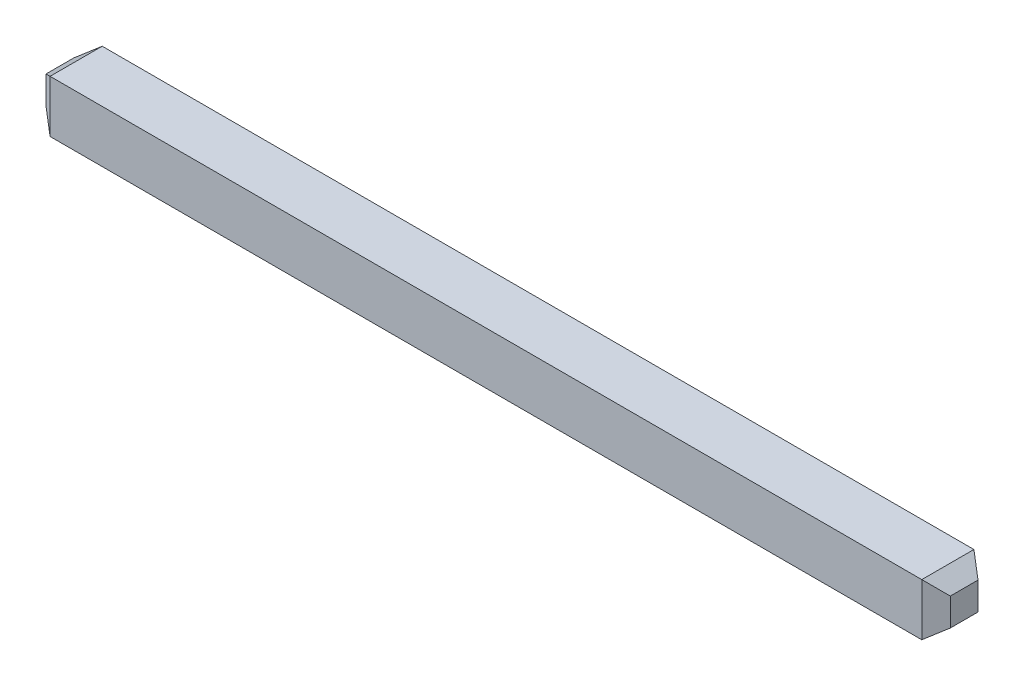
ISO-10303-21;
HEADER;
FILE_DESCRIPTION(('STEP AP214'),'2;1');
FILE_NAME('part.step','',(''),(''),'','','');
FILE_SCHEMA(('AUTOMOTIVE_DESIGN { 1 0 10303 214 1 1 1 1 }'));
ENDSEC;
DATA;
#1=APPLICATION_CONTEXT('core data for automotive mechanical design processes');
#2=APPLICATION_PROTOCOL_DEFINITION('international standard','automotive_design',2000,#1);
#3=PRODUCT_CONTEXT('',#1,'mechanical');
#4=PRODUCT('Part','Part','',(#3));
#5=PRODUCT_RELATED_PRODUCT_CATEGORY('part','',(#4));
#6=PRODUCT_DEFINITION_FORMATION('','',#4);
#7=PRODUCT_DEFINITION_CONTEXT('part definition',#1,'design');
#8=PRODUCT_DEFINITION('design','',#6,#7);
#9=PRODUCT_DEFINITION_SHAPE('','',#8);
#10=(LENGTH_UNIT() NAMED_UNIT(*) SI_UNIT(.MILLI.,.METRE.));
#11=(NAMED_UNIT(*) PLANE_ANGLE_UNIT() SI_UNIT($,.RADIAN.));
#12=(NAMED_UNIT(*) SI_UNIT($,.STERADIAN.) SOLID_ANGLE_UNIT());
#13=UNCERTAINTY_MEASURE_WITH_UNIT(LENGTH_MEASURE(1.E-05),#10,'distance_accuracy_value','');
#14=(GEOMETRIC_REPRESENTATION_CONTEXT(3) GLOBAL_UNCERTAINTY_ASSIGNED_CONTEXT((#13)) GLOBAL_UNIT_ASSIGNED_CONTEXT((#10,
#11,#12)) REPRESENTATION_CONTEXT('',''));
#15=CARTESIAN_POINT('',(0.,0.,0.));
#16=DIRECTION('',(0.,0.,1.));
#17=DIRECTION('',(1.,0.,0.));
#18=AXIS2_PLACEMENT_3D('',#15,#16,#17);
#19=CARTESIAN_POINT('',(-2.4,3.525,-1.27));
#20=DIRECTION('',(0.6,0.8,0.));
#21=DIRECTION('',(-0.8,0.6,0.));
#22=AXIS2_PLACEMENT_3D('',#19,#20,#21);
#23=PLANE('',#22);
#24=DIRECTION('',(0.,0.,1.));
#25=VECTOR('',#24,1.);
#26=CARTESIAN_POINT('',(-2.3,3.45,-1.27));
#27=LINE('',#26,#25);
#28=CARTESIAN_POINT('',(-2.3,3.45,-1.59));
#29=VERTEX_POINT('',#28);
#30=CARTESIAN_POINT('',(-2.30000000000001,3.45,-0.9499999999999));
#31=VERTEX_POINT('',#30);
#32=EDGE_CURVE('E105',#29,#31,#27,.T.);
#33=ORIENTED_EDGE('',*,*,#32,.T.);
#34=DIRECTION('',(0.685994340569492,-0.514495755427436,0.514495755428341));
#35=VECTOR('',#34,1.);
#36=CARTESIAN_POINT('',(-2.49999999999991,3.6,-1.10000000000011));
#37=LINE('',#36,#35);
#38=CARTESIAN_POINT('',(-2.49999999999998,3.6,-1.10000000000003));
#39=VERTEX_POINT('',#38);
#40=EDGE_CURVE('E92',#39,#31,#37,.T.);
#41=ORIENTED_EDGE('',*,*,#40,.F.);
#42=DIRECTION('',(0.,0.,-1.));
#43=VECTOR('',#42,1.);
#44=CARTESIAN_POINT('',(-2.5,3.6,-1.27));
#45=LINE('',#44,#43);
#46=CARTESIAN_POINT('',(-2.5,3.6,-1.44));
#47=VERTEX_POINT('',#46);
#48=EDGE_CURVE('E79',#39,#47,#45,.T.);
#49=ORIENTED_EDGE('',*,*,#48,.T.);
#50=DIRECTION('',(0.685994340570035,-0.514495755427526,-0.514495755427527));
#51=VECTOR('',#50,1.);
#52=CARTESIAN_POINT('',(-2.5,3.6,-1.44));
#53=LINE('',#52,#51);
#54=EDGE_CURVE('E20',#47,#29,#53,.T.);
#55=ORIENTED_EDGE('',*,*,#54,.T.);
#56=EDGE_LOOP('',(#33,#41,#49,#55));
#57=FACE_BOUND('',#56,.T.);
#58=ADVANCED_FACE('F17',(#57),#23,.F.);
#59=CARTESIAN_POINT('',(8.5,3.525,-1.27));
#60=DIRECTION('',(-0.6,0.8,0.));
#61=DIRECTION('',(-0.8,-0.6,0.));
#62=AXIS2_PLACEMENT_3D('',#59,#60,#61);
#63=PLANE('',#62);
#64=DIRECTION('',(0.,0.,-1.));
#65=VECTOR('',#64,1.);
#66=CARTESIAN_POINT('',(8.6,3.6,-1.27));
#67=LINE('',#66,#65);
#68=CARTESIAN_POINT('',(8.59999999999996,3.6,-1.10000000000006));
#69=VERTEX_POINT('',#68);
#70=CARTESIAN_POINT('',(8.6,3.6,-1.44));
#71=VERTEX_POINT('',#70);
#72=EDGE_CURVE('E114',#69,#71,#67,.T.);
#73=ORIENTED_EDGE('',*,*,#72,.F.);
#74=DIRECTION('',(0.685994340569491,0.514495755427438,-0.514495755428341));
#75=VECTOR('',#74,1.);
#76=CARTESIAN_POINT('',(8.40000000000004,3.45,-0.949999999999851));
#77=LINE('',#76,#75);
#78=CARTESIAN_POINT('',(8.40000000000001,3.45,-0.949999999999906));
#79=VERTEX_POINT('',#78);
#80=EDGE_CURVE('E109',#79,#69,#77,.T.);
#81=ORIENTED_EDGE('',*,*,#80,.F.);
#82=DIRECTION('',(0.,0.,1.));
#83=VECTOR('',#82,1.);
#84=CARTESIAN_POINT('',(8.4,3.45,-1.27));
#85=LINE('',#84,#83);
#86=CARTESIAN_POINT('',(8.4,3.45,-1.59));
#87=VERTEX_POINT('',#86);
#88=EDGE_CURVE('E103',#79,#87,#85,.F.);
#89=ORIENTED_EDGE('',*,*,#88,.T.);
#90=DIRECTION('',(0.685994340570034,0.514495755427529,0.514495755427526));
#91=VECTOR('',#90,1.);
#92=CARTESIAN_POINT('',(8.4,3.45,-1.59));
#93=LINE('',#92,#91);
#94=EDGE_CURVE('E107',#87,#71,#93,.T.);
#95=ORIENTED_EDGE('',*,*,#94,.T.);
#96=EDGE_LOOP('',(#73,#81,#89,#95));
#97=FACE_BOUND('',#96,.T.);
#98=ADVANCED_FACE('F175',(#97),#63,.F.);
#99=CARTESIAN_POINT('',(-2.4,3.77,-1.515));
#100=DIRECTION('',(0.6,0.,0.8));
#101=DIRECTION('',(0.8,0.,-0.6));
#102=AXIS2_PLACEMENT_3D('',#99,#100,#101);
#103=PLANE('',#102);
#104=DIRECTION('',(0.,1.,0.));
#105=VECTOR('',#104,1.);
#106=CARTESIAN_POINT('',(-2.3,3.77,-1.59));
#107=LINE('',#106,#105);
#108=CARTESIAN_POINT('',(-2.3,4.09,-1.59));
#109=VERTEX_POINT('',#108);
#110=EDGE_CURVE('E88',#109,#29,#107,.F.);
#111=ORIENTED_EDGE('',*,*,#110,.T.);
#112=ORIENTED_EDGE('',*,*,#54,.F.);
#113=DIRECTION('',(0.,1.,0.));
#114=VECTOR('',#113,1.);
#115=CARTESIAN_POINT('',(-2.5,3.77,-1.44));
#116=LINE('',#115,#114);
#117=CARTESIAN_POINT('',(-2.5,3.94,-1.44));
#118=VERTEX_POINT('',#117);
#119=EDGE_CURVE('E85',#47,#118,#116,.T.);
#120=ORIENTED_EDGE('',*,*,#119,.T.);
#121=DIRECTION('',(-0.685994340570035,-0.514495755427526,0.514495755427527));
#122=VECTOR('',#121,1.);
#123=CARTESIAN_POINT('',(-2.3,4.09,-1.59));
#124=LINE('',#123,#122);
#125=EDGE_CURVE('E126',#109,#118,#124,.T.);
#126=ORIENTED_EDGE('',*,*,#125,.F.);
#127=EDGE_LOOP('',(#111,#112,#120,#126));
#128=FACE_BOUND('',#127,.T.);
#129=ADVANCED_FACE('F84',(#128),#103,.F.);
#130=CARTESIAN_POINT('',(-2.5,3.77,-1.27));
#131=DIRECTION('',(1.,0.,0.));
#132=DIRECTION('',(0.,0.,-1.));
#133=AXIS2_PLACEMENT_3D('',#130,#131,#132);
#134=PLANE('',#133);
#135=DIRECTION('',(0.,1.,0.));
#136=VECTOR('',#135,1.);
#137=CARTESIAN_POINT('',(-2.49999999999991,3.77,-1.10000000000011));
#138=LINE('',#137,#136);
#139=CARTESIAN_POINT('',(-2.49999999999998,3.94,-1.10000000000003));
#140=VERTEX_POINT('',#139);
#141=EDGE_CURVE('E94',#140,#39,#138,.F.);
#142=ORIENTED_EDGE('',*,*,#141,.F.);
#143=DIRECTION('',(0.,0.,1.));
#144=VECTOR('',#143,1.);
#145=CARTESIAN_POINT('',(-2.5,3.94,-1.27));
#146=LINE('',#145,#144);
#147=EDGE_CURVE('E98',#118,#140,#146,.T.);
#148=ORIENTED_EDGE('',*,*,#147,.F.);
#149=ORIENTED_EDGE('',*,*,#119,.F.);
#150=ORIENTED_EDGE('',*,*,#48,.F.);
#151=EDGE_LOOP('',(#142,#148,#149,#150));
#152=FACE_BOUND('',#151,.T.);
#153=ADVANCED_FACE('F96',(#152),#134,.F.);
#154=CARTESIAN_POINT('',(-2.4,3.77,-1.025));
#155=DIRECTION('',(-0.600000000000912,0.,0.799999999999316));
#156=DIRECTION('',(0.799999999999316,0.,0.600000000000912));
#157=AXIS2_PLACEMENT_3D('',#154,#155,#156);
#158=PLANE('',#157);
#159=ORIENTED_EDGE('',*,*,#40,.T.);
#160=DIRECTION('',(0.,1.,0.));
#161=VECTOR('',#160,1.);
#162=CARTESIAN_POINT('',(-2.3,3.77,-0.95));
#163=LINE('',#162,#161);
#164=CARTESIAN_POINT('',(-2.30000000000002,4.09,-0.949999999999888));
#165=VERTEX_POINT('',#164);
#166=EDGE_CURVE('E132',#165,#31,#163,.F.);
#167=ORIENTED_EDGE('',*,*,#166,.F.);
#168=DIRECTION('',(0.685994340569914,0.514495755427435,0.514495755427779));
#169=VECTOR('',#168,1.);
#170=CARTESIAN_POINT('',(-2.5,3.94,-1.1));
#171=LINE('',#170,#169);
#172=EDGE_CURVE('E129',#140,#165,#171,.T.);
#173=ORIENTED_EDGE('',*,*,#172,.F.);
#174=ORIENTED_EDGE('',*,*,#141,.T.);
#175=EDGE_LOOP('',(#159,#167,#173,#174));
#176=FACE_BOUND('',#175,.T.);
#177=ADVANCED_FACE('F186',(#176),#158,.T.);
#178=CARTESIAN_POINT('',(3.05,3.45,-1.27));
#179=DIRECTION('',(0.,1.,0.));
#180=DIRECTION('',(0.,0.,1.));
#181=AXIS2_PLACEMENT_3D('',#178,#179,#180);
#182=PLANE('',#181);
#183=ORIENTED_EDGE('',*,*,#32,.F.);
#184=DIRECTION('',(1.,0.,0.));
#185=VECTOR('',#184,1.);
#186=CARTESIAN_POINT('',(3.05,3.45,-1.59));
#187=LINE('',#186,#185);
#188=EDGE_CURVE('E123',#29,#87,#187,.T.);
#189=ORIENTED_EDGE('',*,*,#188,.T.);
#190=ORIENTED_EDGE('',*,*,#88,.F.);
#191=DIRECTION('',(1.,0.,0.));
#192=VECTOR('',#191,1.);
#193=CARTESIAN_POINT('',(3.05,3.45,-0.95));
#194=LINE('',#193,#192);
#195=EDGE_CURVE('E135',#31,#79,#194,.T.);
#196=ORIENTED_EDGE('',*,*,#195,.F.);
#197=EDGE_LOOP('',(#183,#189,#190,#196));
#198=FACE_BOUND('',#197,.T.);
#199=ADVANCED_FACE('F179',(#198),#182,.F.);
#200=CARTESIAN_POINT('',(8.5,3.77,-1.515));
#201=DIRECTION('',(-0.6,0.,0.8));
#202=DIRECTION('',(0.8,0.,0.6));
#203=AXIS2_PLACEMENT_3D('',#200,#201,#202);
#204=PLANE('',#203);
#205=DIRECTION('',(0.,1.,0.));
#206=VECTOR('',#205,1.);
#207=CARTESIAN_POINT('',(8.6,3.77,-1.44));
#208=LINE('',#207,#206);
#209=CARTESIAN_POINT('',(8.6,3.94,-1.44));
#210=VERTEX_POINT('',#209);
#211=EDGE_CURVE('E117',#71,#210,#208,.T.);
#212=ORIENTED_EDGE('',*,*,#211,.F.);
#213=ORIENTED_EDGE('',*,*,#94,.F.);
#214=DIRECTION('',(0.,1.,0.));
#215=VECTOR('',#214,1.);
#216=CARTESIAN_POINT('',(8.4,3.77,-1.59));
#217=LINE('',#216,#215);
#218=CARTESIAN_POINT('',(8.4,4.09,-1.59));
#219=VERTEX_POINT('',#218);
#220=EDGE_CURVE('E120',#87,#219,#217,.T.);
#221=ORIENTED_EDGE('',*,*,#220,.T.);
#222=DIRECTION('',(-0.685994340570034,0.514495755427526,-0.514495755427529));
#223=VECTOR('',#222,1.);
#224=CARTESIAN_POINT('',(8.6,3.94,-1.44));
#225=LINE('',#224,#223);
#226=EDGE_CURVE('E140',#210,#219,#225,.T.);
#227=ORIENTED_EDGE('',*,*,#226,.F.);
#228=EDGE_LOOP('',(#212,#213,#221,#227));
#229=FACE_BOUND('',#228,.T.);
#230=ADVANCED_FACE('F167',(#229),#204,.F.);
#231=CARTESIAN_POINT('',(8.5,3.77,-1.025));
#232=DIRECTION('',(0.600000000000912,0.,0.799999999999316));
#233=DIRECTION('',(0.799999999999316,0.,-0.600000000000912));
#234=AXIS2_PLACEMENT_3D('',#231,#232,#233);
#235=PLANE('',#234);
#236=DIRECTION('',(0.685994340569913,-0.514495755427435,-0.514495755427781));
#237=VECTOR('',#236,1.);
#238=CARTESIAN_POINT('',(8.4,4.09,-0.9499999999999));
#239=LINE('',#238,#237);
#240=CARTESIAN_POINT('',(8.40000000000002,4.09,-0.9499999999999));
#241=VERTEX_POINT('',#240);
#242=CARTESIAN_POINT('',(8.59999999999996,3.94,-1.10000000000006));
#243=VERTEX_POINT('',#242);
#244=EDGE_CURVE('E35',#241,#243,#239,.T.);
#245=ORIENTED_EDGE('',*,*,#244,.F.);
#246=DIRECTION('',(0.,1.,0.));
#247=VECTOR('',#246,1.);
#248=CARTESIAN_POINT('',(8.4,3.77,-0.95));
#249=LINE('',#248,#247);
#250=EDGE_CURVE('E138',#79,#241,#249,.T.);
#251=ORIENTED_EDGE('',*,*,#250,.F.);
#252=ORIENTED_EDGE('',*,*,#80,.T.);
#253=DIRECTION('',(0.,1.,0.));
#254=VECTOR('',#253,1.);
#255=CARTESIAN_POINT('',(8.6,3.77,-1.1));
#256=LINE('',#255,#254);
#257=EDGE_CURVE('E111',#243,#69,#256,.F.);
#258=ORIENTED_EDGE('',*,*,#257,.F.);
#259=EDGE_LOOP('',(#245,#251,#252,#258));
#260=FACE_BOUND('',#259,.T.);
#261=ADVANCED_FACE('F211',(#260),#235,.T.);
#262=CARTESIAN_POINT('',(8.6,3.77,-1.27));
#263=DIRECTION('',(1.,0.,0.));
#264=DIRECTION('',(0.,0.,-1.));
#265=AXIS2_PLACEMENT_3D('',#262,#263,#264);
#266=PLANE('',#265);
#267=ORIENTED_EDGE('',*,*,#211,.T.);
#268=DIRECTION('',(0.,0.,1.));
#269=VECTOR('',#268,1.);
#270=CARTESIAN_POINT('',(8.6,3.94,-1.27));
#271=LINE('',#270,#269);
#272=EDGE_CURVE('E144',#243,#210,#271,.F.);
#273=ORIENTED_EDGE('',*,*,#272,.F.);
#274=ORIENTED_EDGE('',*,*,#257,.T.);
#275=ORIENTED_EDGE('',*,*,#72,.T.);
#276=EDGE_LOOP('',(#267,#273,#274,#275));
#277=FACE_BOUND('',#276,.T.);
#278=ADVANCED_FACE('F172',(#277),#266,.T.);
#279=CARTESIAN_POINT('',(3.05,3.77,-1.59));
#280=DIRECTION('',(0.,0.,1.));
#281=DIRECTION('',(1.,0.,0.));
#282=AXIS2_PLACEMENT_3D('',#279,#280,#281);
#283=PLANE('',#282);
#284=ORIENTED_EDGE('',*,*,#110,.F.);
#285=DIRECTION('',(1.,0.,0.));
#286=VECTOR('',#285,1.);
#287=CARTESIAN_POINT('',(3.05,4.09,-1.59));
#288=LINE('',#287,#286);
#289=EDGE_CURVE('E147',#219,#109,#288,.F.);
#290=ORIENTED_EDGE('',*,*,#289,.F.);
#291=ORIENTED_EDGE('',*,*,#220,.F.);
#292=ORIENTED_EDGE('',*,*,#188,.F.);
#293=EDGE_LOOP('',(#284,#290,#291,#292));
#294=FACE_BOUND('',#293,.T.);
#295=ADVANCED_FACE('F181',(#294),#283,.F.);
#296=CARTESIAN_POINT('',(-2.4,4.015,-1.27));
#297=DIRECTION('',(-0.6,0.8,0.));
#298=DIRECTION('',(-0.8,-0.6,0.));
#299=AXIS2_PLACEMENT_3D('',#296,#297,#298);
#300=PLANE('',#299);
#301=ORIENTED_EDGE('',*,*,#172,.T.);
#302=DIRECTION('',(0.,0.,1.));
#303=VECTOR('',#302,1.);
#304=CARTESIAN_POINT('',(-2.3,4.09,-1.27));
#305=LINE('',#304,#303);
#306=EDGE_CURVE('E150',#109,#165,#305,.T.);
#307=ORIENTED_EDGE('',*,*,#306,.F.);
#308=ORIENTED_EDGE('',*,*,#125,.T.);
#309=ORIENTED_EDGE('',*,*,#147,.T.);
#310=EDGE_LOOP('',(#301,#307,#308,#309));
#311=FACE_BOUND('',#310,.T.);
#312=ADVANCED_FACE('F183',(#311),#300,.T.);
#313=CARTESIAN_POINT('',(3.05,3.77,-0.95));
#314=DIRECTION('',(0.,0.,1.));
#315=DIRECTION('',(1.,0.,0.));
#316=AXIS2_PLACEMENT_3D('',#313,#314,#315);
#317=PLANE('',#316);
#318=ORIENTED_EDGE('',*,*,#195,.T.);
#319=ORIENTED_EDGE('',*,*,#250,.T.);
#320=DIRECTION('',(1.,0.,0.));
#321=VECTOR('',#320,1.);
#322=CARTESIAN_POINT('',(3.05,4.09,-0.9499999999999));
#323=LINE('',#322,#321);
#324=EDGE_CURVE('E26',#165,#241,#323,.T.);
#325=ORIENTED_EDGE('',*,*,#324,.F.);
#326=ORIENTED_EDGE('',*,*,#166,.T.);
#327=EDGE_LOOP('',(#318,#319,#325,#326));
#328=FACE_BOUND('',#327,.T.);
#329=ADVANCED_FACE('F160',(#328),#317,.T.);
#330=CARTESIAN_POINT('',(8.5,4.015,-1.27));
#331=DIRECTION('',(0.6,0.8,0.));
#332=DIRECTION('',(-0.8,0.6,0.));
#333=AXIS2_PLACEMENT_3D('',#330,#331,#332);
#334=PLANE('',#333);
#335=ORIENTED_EDGE('',*,*,#244,.T.);
#336=ORIENTED_EDGE('',*,*,#272,.T.);
#337=ORIENTED_EDGE('',*,*,#226,.T.);
#338=DIRECTION('',(0.,0.,1.));
#339=VECTOR('',#338,1.);
#340=CARTESIAN_POINT('',(8.4,4.09,-1.27));
#341=LINE('',#340,#339);
#342=EDGE_CURVE('E11',#241,#219,#341,.F.);
#343=ORIENTED_EDGE('',*,*,#342,.F.);
#344=EDGE_LOOP('',(#335,#336,#337,#343));
#345=FACE_BOUND('',#344,.T.);
#346=ADVANCED_FACE('F163',(#345),#334,.T.);
#347=CARTESIAN_POINT('',(3.05,4.09,-1.27));
#348=DIRECTION('',(0.,1.,0.));
#349=DIRECTION('',(0.,0.,1.));
#350=AXIS2_PLACEMENT_3D('',#347,#348,#349);
#351=PLANE('',#350);
#352=ORIENTED_EDGE('',*,*,#324,.T.);
#353=ORIENTED_EDGE('',*,*,#342,.T.);
#354=ORIENTED_EDGE('',*,*,#289,.T.);
#355=ORIENTED_EDGE('',*,*,#306,.T.);
#356=EDGE_LOOP('',(#352,#353,#354,#355));
#357=FACE_BOUND('',#356,.T.);
#358=ADVANCED_FACE('F156',(#357),#351,.T.);
#359=CLOSED_SHELL('',(#58,#98,#129,#153,#177,#199,#230,#261,#278,#295,#312,#329,#346,#358));
#360=MANIFOLD_SOLID_BREP('B1',#359);
#361=ADVANCED_BREP_SHAPE_REPRESENTATION('',(#18,#360),#14);
#362=SHAPE_DEFINITION_REPRESENTATION(#9,#361);
ENDSEC;
END-ISO-10303-21;
